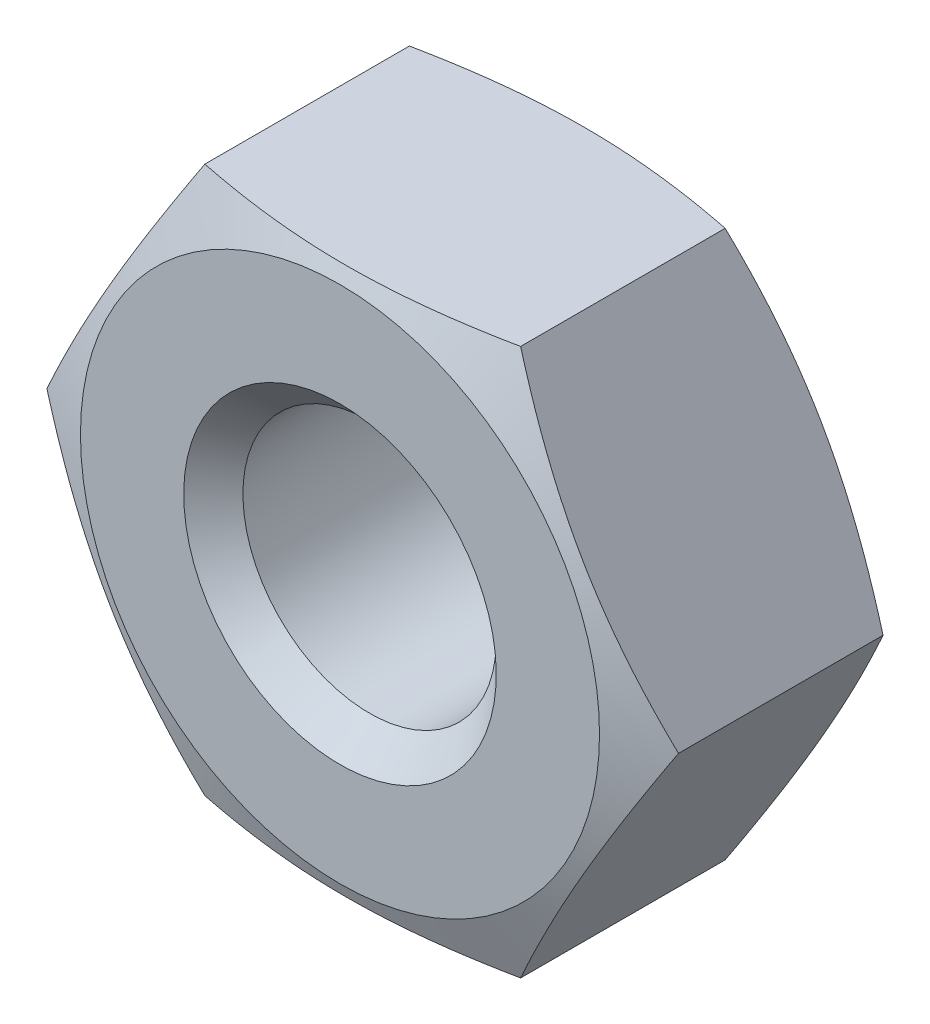
ISO-10303-21;
HEADER;
FILE_DESCRIPTION(('STEP AP214'),'2;1');
FILE_NAME('part.step','',(''),(''),'','','');
FILE_SCHEMA(('AUTOMOTIVE_DESIGN { 1 0 10303 214 1 1 1 1 }'));
ENDSEC;
DATA;
#1=APPLICATION_CONTEXT('core data for automotive mechanical design processes');
#2=APPLICATION_PROTOCOL_DEFINITION('international standard','automotive_design',2000,#1);
#3=PRODUCT_CONTEXT('',#1,'mechanical');
#4=PRODUCT('Part','Part','',(#3));
#5=PRODUCT_RELATED_PRODUCT_CATEGORY('part','',(#4));
#6=PRODUCT_DEFINITION_FORMATION('','',#4);
#7=PRODUCT_DEFINITION_CONTEXT('part definition',#1,'design');
#8=PRODUCT_DEFINITION('design','',#6,#7);
#9=PRODUCT_DEFINITION_SHAPE('','',#8);
#10=(LENGTH_UNIT() NAMED_UNIT(*) SI_UNIT(.MILLI.,.METRE.));
#11=(NAMED_UNIT(*) PLANE_ANGLE_UNIT() SI_UNIT($,.RADIAN.));
#12=(NAMED_UNIT(*) SI_UNIT($,.STERADIAN.) SOLID_ANGLE_UNIT());
#13=UNCERTAINTY_MEASURE_WITH_UNIT(LENGTH_MEASURE(1.E-05),#10,'distance_accuracy_value','');
#14=(GEOMETRIC_REPRESENTATION_CONTEXT(3) GLOBAL_UNCERTAINTY_ASSIGNED_CONTEXT((#13)) GLOBAL_UNIT_ASSIGNED_CONTEXT((#10,
#11,#12)) REPRESENTATION_CONTEXT('',''));
#15=CARTESIAN_POINT('',(0.,0.,0.));
#16=DIRECTION('',(0.,0.,1.));
#17=DIRECTION('',(1.,0.,0.));
#18=AXIS2_PLACEMENT_3D('',#15,#16,#17);
#19=CARTESIAN_POINT('',(0.,0.,0.));
#20=DIRECTION('',(0.,0.,1.));
#21=DIRECTION('',(0.,-1.,0.));
#22=AXIS2_PLACEMENT_3D('',#19,#20,#21);
#23=CONICAL_SURFACE('',#22,3.32142473355163,1.18682389135614);
#24=CARTESIAN_POINT('',(0.,0.,0.));
#25=DIRECTION('',(0.,0.,1.));
#26=DIRECTION('',(1.,0.,0.));
#27=AXIS2_PLACEMENT_3D('',#24,#25,#26);
#28=CIRCLE('',#27,3.32142473355163);
#29=CARTESIAN_POINT('',(3.32142473355163,0.,0.));
#30=VERTEX_POINT('',#29);
#31=EDGE_CURVE('E26',#30,#30,#28,.T.);
#32=ORIENTED_EDGE('',*,*,#31,.T.);
#33=EDGE_LOOP('',(#32));
#34=FACE_BOUND('',#33,.T.);
#35=CARTESIAN_POINT('',(2.02072384529946,3.50000036812462,0.290909557438591));
#36=CARTESIAN_POINT('',(2.09132255034,3.37771982404585,0.262384166173461));
#37=CARTESIAN_POINT('',(2.16215427324609,3.25503568118485,0.236007850277796));
#38=CARTESIAN_POINT('',(2.30428608585132,3.00885616038073,0.188364048957386));
#39=CARTESIAN_POINT('',(2.37558642498468,2.88536035040487,0.167099556959751));
#40=CARTESIAN_POINT('',(2.51855398210177,2.63773327764406,0.130530773869635));
#41=CARTESIAN_POINT('',(2.59022108477342,2.5136022145855,0.115224713605103));
#42=CARTESIAN_POINT('',(2.73382150463953,2.26487899138918,0.0912821023845898));
#43=CARTESIAN_POINT('',(2.80575475967239,2.14028693891846,0.0826440820646217));
#44=CARTESIAN_POINT('',(2.9485261877914,1.89299957154715,0.0725747154128586));
#45=CARTESIAN_POINT('',(3.01936221521324,1.77030797304619,0.0710234885768341));
#46=CARTESIAN_POINT('',(3.16099241001165,1.52499727976948,0.0748851451105576));
#47=CARTESIAN_POINT('',(3.23178657316066,1.40237819231606,0.0802986407331931));
#48=CARTESIAN_POINT('',(3.37311509902853,1.15759000495409,0.0977982137314881));
#49=CARTESIAN_POINT('',(3.4436496078532,1.03542065198286,0.109879661807571));
#50=CARTESIAN_POINT('',(3.58439008838827,0.791650989014452,0.140131203947854));
#51=CARTESIAN_POINT('',(3.65459605425069,0.670050689146307,0.158301405975728));
#52=CARTESIAN_POINT('',(3.75107715753959,0.502940516279635,0.187023064048246));
#53=CARTESIAN_POINT('',(3.77752810257727,0.457126135566159,0.195287900081437));
#54=CARTESIAN_POINT('',(3.83036756262534,0.365605506118386,0.212537278382668));
#55=CARTESIAN_POINT('',(3.85675608642679,0.319899242157537,0.221521712221243));
#56=CARTESIAN_POINT('',(3.90956322437695,0.228434596225564,0.240200703604558));
#57=CARTESIAN_POINT('',(3.93598163188813,0.182676572161136,0.249897588545801));
#58=CARTESIAN_POINT('',(3.98876056400169,0.0912607801712255,0.269933042005469));
#59=CARTESIAN_POINT('',(4.01512108199967,0.0456030236848843,0.280271680164017));
#60=CARTESIAN_POINT('',(4.04145115470054,-2.00000000010724E-06,0.290909557438591));
#61=B_SPLINE_CURVE_WITH_KNOTS('',3,(#35,#36,#37,#38,#39,#40,#41,#42,#43,#44,#45,#46,#47,#48,#49,
#50,#51,#52,#53,#54,#55,#56,#57,#58,#59,#60),.UNSPECIFIED.,.F.,.F.,(4,2,2,2,2,2,2,2,2,2,2,2,4),
(0.,0.432180292003572,0.864613050816601,1.29691731398269,1.72912628770946,2.15399624694487,
2.57890355808278,3.00351624303523,3.42813645747093,3.58876423240477,3.74936784921124,
3.91052168590197,4.0716930409457),.UNSPECIFIED.);
#62=CARTESIAN_POINT('',(2.020725,3.49999836812462,0.290909090909091));
#63=VERTEX_POINT('',#62);
#64=CARTESIAN_POINT('',(4.04145,0.,0.290909090909091));
#65=VERTEX_POINT('',#64);
#66=EDGE_CURVE('E183',#63,#65,#61,.T.);
#67=ORIENTED_EDGE('',*,*,#66,.T.);
#68=CARTESIAN_POINT('',(4.04145115470054,2.E-06,0.290909557438591));
#69=CARTESIAN_POINT('',(3.97085244966001,-0.122278544078773,0.262384166173461));
#70=CARTESIAN_POINT('',(3.90002072675391,-0.244962686939771,0.236007850277796));
#71=CARTESIAN_POINT('',(3.75788891414868,-0.491142207743888,0.188364048957386));
#72=CARTESIAN_POINT('',(3.68658857501532,-0.614638017719752,0.167099556959751));
#73=CARTESIAN_POINT('',(3.54362101789823,-0.862265090480561,0.130530773869635));
#74=CARTESIAN_POINT('',(3.47195391522658,-0.986396153539121,0.115224713605103));
#75=CARTESIAN_POINT('',(3.32835349536047,-1.23511937673544,0.0912821023845898));
#76=CARTESIAN_POINT('',(3.25642024032762,-1.35971142920615,0.0826440820646216));
#77=CARTESIAN_POINT('',(3.1136488122086,-1.60699879657746,0.0725747154128586));
#78=CARTESIAN_POINT('',(3.04281278478676,-1.72969039507843,0.0710234885768343));
#79=CARTESIAN_POINT('',(2.90118258998835,-1.97500108835514,0.0748851451105578));
#80=CARTESIAN_POINT('',(2.83038842683934,-2.09762017580856,0.0802986407331932));
#81=CARTESIAN_POINT('',(2.68905990097147,-2.34240836317053,0.0977982137314883));
#82=CARTESIAN_POINT('',(2.6185253921468,-2.46457771614176,0.109879661807571));
#83=CARTESIAN_POINT('',(2.47778491161173,-2.70834737911017,0.140131203947854));
#84=CARTESIAN_POINT('',(2.40757894574931,-2.82994767897831,0.158301405975728));
#85=CARTESIAN_POINT('',(2.31109784246041,-2.99705785184499,0.187023064048246));
#86=CARTESIAN_POINT('',(2.28464689742273,-3.04287223255846,0.195287900081437));
#87=CARTESIAN_POINT('',(2.23180743737466,-3.13439286200624,0.212537278382668));
#88=CARTESIAN_POINT('',(2.20541891357321,-3.18009912596708,0.221521712221243));
#89=CARTESIAN_POINT('',(2.15261177562305,-3.27156377189906,0.240200703604558));
#90=CARTESIAN_POINT('',(2.12619336811187,-3.31732179596348,0.249897588545801));
#91=CARTESIAN_POINT('',(2.07341443599831,-3.40873758795339,0.269933042005469));
#92=CARTESIAN_POINT('',(2.04705391800033,-3.45439534443974,0.280271680164018));
#93=CARTESIAN_POINT('',(2.02072384529946,-3.50000036812462,0.290909557438591));
#94=B_SPLINE_CURVE_WITH_KNOTS('',3,(#68,#69,#70,#71,#72,#73,#74,#75,#76,#77,#78,#79,#80,#81,#82,
#83,#84,#85,#86,#87,#88,#89,#90,#91,#92,#93),.UNSPECIFIED.,.F.,.F.,(4,2,2,2,2,2,2,2,2,2,2,2,4),
(0.,0.432180292003572,0.864613050816601,1.29691731398269,1.72912628770947,2.15399624694487,
2.57890355808279,3.00351624303523,3.42813645747093,3.58876423240478,3.74936784921125,
3.91052168590198,4.07169304094571),.UNSPECIFIED.);
#95=CARTESIAN_POINT('',(2.020725,-3.49999836812462,0.290909090909091));
#96=VERTEX_POINT('',#95);
#97=EDGE_CURVE('E33',#65,#96,#94,.T.);
#98=ORIENTED_EDGE('',*,*,#97,.T.);
#99=CARTESIAN_POINT('',(-5.34553881756547,-3.49999836812462,1.23955326396827));
#100=CARTESIAN_POINT('',(-5.18762264254,-3.49999836812462,1.18619003500022));
#101=CARTESIAN_POINT('',(-5.02949661339175,-3.49999836812462,1.13343638207835));
#102=CARTESIAN_POINT('',(-4.71271625132204,-3.49999836812462,1.02948880535383));
#103=CARTESIAN_POINT('',(-4.5540618683599,-3.49999836812462,0.978295034234388));
#104=CARTESIAN_POINT('',(-4.2357643457523,-3.49999836812462,0.877697414375918));
#105=CARTESIAN_POINT('',(-4.07611974532071,-3.49999836812462,0.828298170910141));
#106=CARTESIAN_POINT('',(-3.75611019253561,-3.49999836812462,0.731895685603083));
#107=CARTESIAN_POINT('',(-3.59574525773822,-3.49999836812462,0.684892385708541));
#108=CARTESIAN_POINT('',(-3.27623888700588,-3.49999836812462,0.594472747430541));
#109=CARTESIAN_POINT('',(-3.11710839667555,-3.49999836812462,0.551017924543446));
#110=CARTESIAN_POINT('',(-2.79787990473444,-3.49999836812462,0.46777255382096));
#111=CARTESIAN_POINT('',(-2.63778187418168,-3.49999836812462,0.427982116181993));
#112=CARTESIAN_POINT('',(-2.31659647071351,-3.49999836812462,0.353015300891237));
#113=CARTESIAN_POINT('',(-2.15550971461305,-3.49999836812462,0.317836302746271));
#114=CARTESIAN_POINT('',(-1.83218709180317,-3.49999836812462,0.253177369741271));
#115=CARTESIAN_POINT('',(-1.6699512791965,-3.49999836812462,0.223697168381369));
#116=CARTESIAN_POINT('',(-1.37764525829404,-3.49999836812462,0.17698925553565));
#117=CARTESIAN_POINT('',(-1.24777946462564,-3.49999836812462,0.158488793465168));
#118=CARTESIAN_POINT('',(-0.987441249599447,-3.49999836812462,0.126494693607928));
#119=CARTESIAN_POINT('',(-0.856968908113897,-3.49999836812462,0.11300041449888));
#120=CARTESIAN_POINT('',(-0.595642853519168,-3.49999836812462,0.091549504847724));
#121=CARTESIAN_POINT('',(-0.464789416808147,-3.49999836812462,0.0835895503648877));
#122=CARTESIAN_POINT('',(-0.202855028065162,-3.49999836812462,0.0735420763055132));
#123=CARTESIAN_POINT('',(-0.0717740778707208,-3.49999836812462,0.0714545095191927));
#124=CARTESIAN_POINT('',(0.190984740304119,-3.49999836812462,0.0732524329481938));
#125=CARTESIAN_POINT('',(0.322662407086359,-3.49999836812462,0.077167055765279));
#126=CARTESIAN_POINT('',(0.585711212547456,-3.49999836812462,0.090843208473379));
#127=CARTESIAN_POINT('',(0.717082346110813,-3.49999836812462,0.100604835249881));
#128=CARTESIAN_POINT('',(0.97938623667146,-3.49999836812462,0.125563453075726));
#129=CARTESIAN_POINT('',(1.110318659208,-3.49999836812462,0.140763919565631));
#130=CARTESIAN_POINT('',(1.37151539079655,-3.49999836812462,0.176029675990628));
#131=CARTESIAN_POINT('',(1.50177970215209,-3.49999836812462,0.196094949141129));
#132=CARTESIAN_POINT('',(1.93664115430619,-3.49999836812462,0.270318042931076));
#133=CARTESIAN_POINT('',(2.23962712444599,-3.49999836812462,0.333982330885962));
#134=CARTESIAN_POINT('',(2.69125779261715,-3.49999836812462,0.441186370822009));
#135=CARTESIAN_POINT('',(2.84137819783595,-3.49999836812462,0.478887425419062));
#136=CARTESIAN_POINT('',(3.14078451169961,-3.49999836812462,0.557477868316505));
#137=CARTESIAN_POINT('',(3.29007045189538,-3.49999836812462,0.598367135185511));
#138=CARTESIAN_POINT('',(3.73762543539227,-3.49999836812462,0.725085144224423));
#139=CARTESIAN_POINT('',(4.03479692474104,-3.49999836812462,0.814768265604585));
#140=CARTESIAN_POINT('',(4.62691345988182,-3.49999836812462,1.00084877207955));
#141=CARTESIAN_POINT('',(4.92185906558101,-3.49999836812462,1.09724440174606));
#142=CARTESIAN_POINT('',(5.5082044578059,-3.49999836812462,1.29396354290783));
#143=CARTESIAN_POINT('',(5.7996147238003,-3.49999836812462,1.3942559576467));
#144=CARTESIAN_POINT('',(6.3813353040554,-3.49999836812462,1.59803886260046));
#145=CARTESIAN_POINT('',(6.67164553142866,-3.49999836812462,1.70152959976056));
#146=CARTESIAN_POINT('',(7.2494935330203,-3.49999836812462,1.91011313885032));
#147=CARTESIAN_POINT('',(7.53703686264068,-3.49999836812463,2.01519059339234));
#148=CARTESIAN_POINT('',(8.11144984025393,-3.49999836812463,2.22705888137605));
#149=CARTESIAN_POINT('',(8.39831957079732,-3.49999836812463,2.33384949079267));
#150=CARTESIAN_POINT('',(8.684964011713,-3.49999836812463,2.44123143152209));
#151=B_SPLINE_CURVE_WITH_KNOTS('',3,(#99,#100,#101,#102,#103,#104,#105,#106,#107,#108,#109,#110,
#111,#112,#113,#114,#115,#116,#117,#118,#119,#120,#121,#122,#123,#124,#125,#126,#127,#128,#129,
#130,#131,#132,#133,#134,#135,#136,#137,#138,#139,#140,#141,#142,#143,#144,#145,#146,#147,#148,
#149,#150),.UNSPECIFIED.,.F.,.F.,(4,2,2,2,2,2,2,2,2,2,2,2,2,2,2,2,2,2,2,2,2,2,2,2,2,4),(0.,
0.500070610096159,1.000190011517,1.50151328171155,2.00282439915781,2.49766131259613,
2.99251310205319,3.48708245697461,3.98162867814071,4.375075815661,4.76847253280626,
5.16163276949894,5.55478984545646,5.94986122269567,6.34493914649139,6.74026997886341,
7.13559944728154,8.06362736797857,8.5279634818099,8.99228191881982,9.92337262496777,
10.8542207438853,11.778751567274,12.7033539537072,13.6217714521181,14.5400698147867),.UNSPECIFIED.);
#152=CARTESIAN_POINT('',(-2.020725,-3.49999836812462,0.290909090909091));
#153=VERTEX_POINT('',#152);
#154=EDGE_CURVE('E76',#96,#153,#151,.F.);
#155=ORIENTED_EDGE('',*,*,#154,.T.);
#156=CARTESIAN_POINT('',(-2.02072384529946,-3.50000036812462,0.290909557438592));
#157=CARTESIAN_POINT('',(-2.09132255034,-3.37771982404585,0.262384166173461));
#158=CARTESIAN_POINT('',(-2.16215427324609,-3.25503568118485,0.236007850277796));
#159=CARTESIAN_POINT('',(-2.30428608585132,-3.00885616038073,0.188364048957386));
#160=CARTESIAN_POINT('',(-2.37558642498468,-2.88536035040487,0.167099556959751));
#161=CARTESIAN_POINT('',(-2.51855398210177,-2.63773327764406,0.130530773869635));
#162=CARTESIAN_POINT('',(-2.59022108477342,-2.5136022145855,0.115224713605103));
#163=CARTESIAN_POINT('',(-2.73382150463953,-2.26487899138918,0.0912821023845899));
#164=CARTESIAN_POINT('',(-2.80575475967239,-2.14028693891846,0.0826440820646219));
#165=CARTESIAN_POINT('',(-2.94852618779141,-1.89299957154715,0.0725747154128589));
#166=CARTESIAN_POINT('',(-3.01936221521324,-1.77030797304619,0.0710234885768342));
#167=CARTESIAN_POINT('',(-3.16099241001165,-1.52499727976947,0.0748851451105577));
#168=CARTESIAN_POINT('',(-3.23178657316066,-1.40237819231606,0.0802986407331933));
#169=CARTESIAN_POINT('',(-3.37311509902854,-1.15759000495409,0.0977982137314883));
#170=CARTESIAN_POINT('',(-3.4436496078532,-1.03542065198285,0.109879661807571));
#171=CARTESIAN_POINT('',(-3.58439008838827,-0.79165098901445,0.140131203947855));
#172=CARTESIAN_POINT('',(-3.65459605425069,-0.670050689146305,0.158301405975729));
#173=CARTESIAN_POINT('',(-3.75107715753959,-0.502940516279633,0.187023064048246));
#174=CARTESIAN_POINT('',(-3.77752810257727,-0.457126135566158,0.195287900081437));
#175=CARTESIAN_POINT('',(-3.83036756262534,-0.365605506118384,0.212537278382668));
#176=CARTESIAN_POINT('',(-3.85675608642679,-0.319899242157536,0.221521712221243));
#177=CARTESIAN_POINT('',(-3.90956322437695,-0.228434596225564,0.240200703604558));
#178=CARTESIAN_POINT('',(-3.93598163188813,-0.182676572161136,0.249897588545801));
#179=CARTESIAN_POINT('',(-3.98876056400169,-0.0912607801712251,0.269933042005469));
#180=CARTESIAN_POINT('',(-4.01512108199967,-0.0456030236848838,0.280271680164017));
#181=CARTESIAN_POINT('',(-4.04145115470054,2.00000000047332E-06,0.290909557438591));
#182=B_SPLINE_CURVE_WITH_KNOTS('',3,(#156,#157,#158,#159,#160,#161,#162,#163,#164,#165,#166,
#167,#168,#169,#170,#171,#172,#173,#174,#175,#176,#177,#178,#179,#180,#181),.UNSPECIFIED.,.F.,
.F.,(4,2,2,2,2,2,2,2,2,2,2,2,4),(0.,0.432180292003571,0.8646130508166,1.29691731398269,
1.72912628770947,2.15399624694487,2.57890355808279,3.00351624303523,3.42813645747093,
3.58876423240477,3.74936784921125,3.91052168590198,4.07169304094571),.UNSPECIFIED.);
#183=CARTESIAN_POINT('',(-4.04145,0.,0.290909090909091));
#184=VERTEX_POINT('',#183);
#185=EDGE_CURVE('E87',#153,#184,#182,.T.);
#186=ORIENTED_EDGE('',*,*,#185,.T.);
#187=CARTESIAN_POINT('',(-4.04145115470054,-1.99999999944489E-06,0.290909557438591));
#188=CARTESIAN_POINT('',(-3.97085244966001,0.122278544078773,0.262384166173461));
#189=CARTESIAN_POINT('',(-3.90002072675391,0.244962686939772,0.236007850277796));
#190=CARTESIAN_POINT('',(-3.75788891414868,0.491142207743889,0.188364048957386));
#191=CARTESIAN_POINT('',(-3.68658857501532,0.614638017719753,0.167099556959751));
#192=CARTESIAN_POINT('',(-3.54362101789823,0.862265090480562,0.130530773869635));
#193=CARTESIAN_POINT('',(-3.47195391522658,0.986396153539121,0.115224713605103));
#194=CARTESIAN_POINT('',(-3.32835349536047,1.23511937673544,0.0912821023845896));
#195=CARTESIAN_POINT('',(-3.25642024032762,1.35971142920616,0.0826440820646215));
#196=CARTESIAN_POINT('',(-3.1136488122086,1.60699879657747,0.0725747154128584));
#197=CARTESIAN_POINT('',(-3.04281278478676,1.72969039507843,0.071023488576834));
#198=CARTESIAN_POINT('',(-2.90118258998835,1.97500108835514,0.0748851451105575));
#199=CARTESIAN_POINT('',(-2.83038842683934,2.09762017580856,0.0802986407331927));
#200=CARTESIAN_POINT('',(-2.68905990097147,2.34240836317053,0.0977982137314878));
#201=CARTESIAN_POINT('',(-2.6185253921468,2.46457771614176,0.109879661807571));
#202=CARTESIAN_POINT('',(-2.47778491161173,2.70834737911017,0.140131203947854));
#203=CARTESIAN_POINT('',(-2.40757894574931,2.82994767897831,0.158301405975728));
#204=CARTESIAN_POINT('',(-2.31109784246041,2.99705785184499,0.187023064048246));
#205=CARTESIAN_POINT('',(-2.28464689742274,3.04287223255846,0.195287900081437));
#206=CARTESIAN_POINT('',(-2.23180743737466,3.13439286200623,0.212537278382668));
#207=CARTESIAN_POINT('',(-2.20541891357321,3.18009912596708,0.221521712221243));
#208=CARTESIAN_POINT('',(-2.15261177562305,3.27156377189906,0.240200703604558));
#209=CARTESIAN_POINT('',(-2.12619336811187,3.31732179596348,0.249897588545801));
#210=CARTESIAN_POINT('',(-2.07341443599831,3.40873758795339,0.269933042005469));
#211=CARTESIAN_POINT('',(-2.04705391800033,3.45439534443974,0.280271680164017));
#212=CARTESIAN_POINT('',(-2.02072384529946,3.50000036812462,0.290909557438591));
#213=B_SPLINE_CURVE_WITH_KNOTS('',3,(#187,#188,#189,#190,#191,#192,#193,#194,#195,#196,#197,
#198,#199,#200,#201,#202,#203,#204,#205,#206,#207,#208,#209,#210,#211,#212),.UNSPECIFIED.,.F.,
.F.,(4,2,2,2,2,2,2,2,2,2,2,2,4),(0.,0.432180292003572,0.864613050816601,1.29691731398269,
1.72912628770947,2.15399624694487,2.57890355808279,3.00351624303523,3.42813645747093,
3.58876423240477,3.74936784921125,3.91052168590198,4.07169304094571),.UNSPECIFIED.);
#214=CARTESIAN_POINT('',(-2.020725,3.49999836812462,0.290909090909091));
#215=VERTEX_POINT('',#214);
#216=EDGE_CURVE('E93',#184,#215,#213,.T.);
#217=ORIENTED_EDGE('',*,*,#216,.T.);
#218=CARTESIAN_POINT('',(-5.34553881756546,3.49999836812462,1.23955326396827));
#219=CARTESIAN_POINT('',(-5.18762264253999,3.49999836812462,1.18619003500022));
#220=CARTESIAN_POINT('',(-5.02949661339174,3.49999836812462,1.13343638207835));
#221=CARTESIAN_POINT('',(-4.71271625132203,3.49999836812462,1.02948880535383));
#222=CARTESIAN_POINT('',(-4.55406186835989,3.49999836812462,0.978295034234386));
#223=CARTESIAN_POINT('',(-4.23576434575229,3.49999836812462,0.877697414375917));
#224=CARTESIAN_POINT('',(-4.0761197453207,3.49999836812462,0.828298170910139));
#225=CARTESIAN_POINT('',(-3.75611019253561,3.49999836812462,0.731895685603081));
#226=CARTESIAN_POINT('',(-3.59574525773821,3.49999836812462,0.684892385708539));
#227=CARTESIAN_POINT('',(-3.27623888700587,3.49999836812462,0.594472747430539));
#228=CARTESIAN_POINT('',(-3.11710839667555,3.49999836812462,0.551017924543444));
#229=CARTESIAN_POINT('',(-2.79787990473443,3.49999836812462,0.467772553820959));
#230=CARTESIAN_POINT('',(-2.63778187418168,3.49999836812462,0.427982116181991));
#231=CARTESIAN_POINT('',(-2.31659647071351,3.49999836812462,0.353015300891236));
#232=CARTESIAN_POINT('',(-2.15550971461304,3.49999836812462,0.317836302746269));
#233=CARTESIAN_POINT('',(-1.83218709180317,3.49999836812462,0.25317736974127));
#234=CARTESIAN_POINT('',(-1.66995127919649,3.49999836812462,0.223697168381369));
#235=CARTESIAN_POINT('',(-1.37764525829403,3.49999836812462,0.17698925553565));
#236=CARTESIAN_POINT('',(-1.24777946462564,3.49999836812462,0.158488793465167));
#237=CARTESIAN_POINT('',(-0.987441249599443,3.49999836812462,0.126494693607927));
#238=CARTESIAN_POINT('',(-0.856968908113894,3.49999836812462,0.113000414498879));
#239=CARTESIAN_POINT('',(-0.595642853519165,3.49999836812462,0.0915495048477233));
#240=CARTESIAN_POINT('',(-0.464789416808144,3.49999836812462,0.0835895503648871));
#241=CARTESIAN_POINT('',(-0.20285502806516,3.49999836812462,0.0735420763055127));
#242=CARTESIAN_POINT('',(-0.0717740778707185,3.49999836812462,0.0714545095191921));
#243=CARTESIAN_POINT('',(0.190984740304121,3.49999836812462,0.0732524329481931));
#244=CARTESIAN_POINT('',(0.322662407086361,3.49999836812462,0.0771670557652782));
#245=CARTESIAN_POINT('',(0.585711212547458,3.49999836812462,0.0908432084733782));
#246=CARTESIAN_POINT('',(0.717082346110815,3.49999836812462,0.10060483524988));
#247=CARTESIAN_POINT('',(0.979386236671462,3.49999836812462,0.125563453075725));
#248=CARTESIAN_POINT('',(1.11031865920801,3.49999836812462,0.14076391956563));
#249=CARTESIAN_POINT('',(1.37151539079655,3.49999836812462,0.176029675990627));
#250=CARTESIAN_POINT('',(1.5017797021521,3.49999836812462,0.196094949141129));
#251=CARTESIAN_POINT('',(1.93664115430619,3.49999836812462,0.270318042931076));
#252=CARTESIAN_POINT('',(2.23962712444599,3.49999836812462,0.333982330885961));
#253=CARTESIAN_POINT('',(2.69125779261715,3.49999836812462,0.441186370822008));
#254=CARTESIAN_POINT('',(2.84137819783595,3.49999836812462,0.478887425419061));
#255=CARTESIAN_POINT('',(3.14078451169961,3.49999836812462,0.557477868316504));
#256=CARTESIAN_POINT('',(3.29007045189538,3.49999836812462,0.59836713518551));
#257=CARTESIAN_POINT('',(3.73762543539227,3.49999836812462,0.725085144224422));
#258=CARTESIAN_POINT('',(4.03479692474104,3.49999836812462,0.814768265604584));
#259=CARTESIAN_POINT('',(4.62691345988182,3.49999836812462,1.00084877207955));
#260=CARTESIAN_POINT('',(4.92185906558101,3.49999836812462,1.09724440174607));
#261=CARTESIAN_POINT('',(5.50820445780591,3.49999836812462,1.29396354290783));
#262=CARTESIAN_POINT('',(5.79961472380031,3.49999836812462,1.3942559576467));
#263=CARTESIAN_POINT('',(6.38133530405541,3.49999836812462,1.59803886260046));
#264=CARTESIAN_POINT('',(6.67164553142867,3.49999836812462,1.70152959976056));
#265=CARTESIAN_POINT('',(7.24949353302031,3.49999836812462,1.91011313885033));
#266=CARTESIAN_POINT('',(7.53703686264069,3.49999836812462,2.01519059339235));
#267=CARTESIAN_POINT('',(8.11144984025394,3.49999836812462,2.22705888137606));
#268=CARTESIAN_POINT('',(8.39831957079733,3.49999836812462,2.33384949079268));
#269=CARTESIAN_POINT('',(8.68496401171301,3.49999836812462,2.44123143152209));
#270=B_SPLINE_CURVE_WITH_KNOTS('',3,(#218,#219,#220,#221,#222,#223,#224,#225,#226,#227,#228,
#229,#230,#231,#232,#233,#234,#235,#236,#237,#238,#239,#240,#241,#242,#243,#244,#245,#246,#247,
#248,#249,#250,#251,#252,#253,#254,#255,#256,#257,#258,#259,#260,#261,#262,#263,#264,#265,#266,
#267,#268,#269),.UNSPECIFIED.,.F.,.F.,(4,2,2,2,2,2,2,2,2,2,2,2,2,2,2,2,2,2,2,2,2,2,2,2,2,4),(0.,
0.500070610096158,1.000190011517,1.50151328171154,2.00282439915781,2.49766131259613,
2.99251310205318,3.4870824569746,3.9816286781407,4.37507581566099,4.76847253280625,
5.16163276949893,5.55478984545645,5.94986122269566,6.34493914649138,6.7402699788634,
7.13559944728153,8.06362736797856,8.52796348180989,8.99228191881981,9.92337262496776,
10.8542207438853,11.778751567274,12.7033539537072,13.6217714521181,14.5400698147867),.UNSPECIFIED.);
#271=EDGE_CURVE('E189',#215,#63,#270,.T.);
#272=ORIENTED_EDGE('',*,*,#271,.T.);
#273=EDGE_LOOP('',(#67,#98,#155,#186,#217,#272));
#274=FACE_BOUND('',#273,.T.);
#275=ADVANCED_FACE('F16',(#34,#274),#23,.T.);
#276=CARTESIAN_POINT('',(4.04145,0.,0.));
#277=DIRECTION('',(0.,0.,1.));
#278=DIRECTION('',(1.,0.,0.));
#279=AXIS2_PLACEMENT_3D('',#276,#277,#278);
#280=PLANE('',#279);
#281=CARTESIAN_POINT('',(0.,0.,0.));
#282=DIRECTION('',(0.,0.,1.));
#283=DIRECTION('',(1.,0.,0.));
#284=AXIS2_PLACEMENT_3D('',#281,#282,#283);
#285=CIRCLE('',#284,2.);
#286=CARTESIAN_POINT('',(2.,0.,0.));
#287=VERTEX_POINT('',#286);
#288=EDGE_CURVE('E11',#287,#287,#285,.F.);
#289=ORIENTED_EDGE('',*,*,#288,.F.);
#290=EDGE_LOOP('',(#289));
#291=FACE_BOUND('',#290,.T.);
#292=ORIENTED_EDGE('',*,*,#31,.F.);
#293=EDGE_LOOP('',(#292));
#294=FACE_BOUND('',#293,.T.);
#295=ADVANCED_FACE('F211',(#291,#294),#280,.F.);
#296=CARTESIAN_POINT('',(0.,0.,3.2));
#297=DIRECTION('',(0.,0.,1.));
#298=DIRECTION('',(0.,-1.,0.));
#299=AXIS2_PLACEMENT_3D('',#296,#297,#298);
#300=CONICAL_SURFACE('',#299,2.,0.785398163397448);
#301=CARTESIAN_POINT('',(0.,0.,2.821125));
#302=DIRECTION('',(0.,0.,-1.));
#303=DIRECTION('',(0.,1.,0.));
#304=AXIS2_PLACEMENT_3D('',#301,#302,#303);
#305=CIRCLE('',#304,1.621125);
#306=CARTESIAN_POINT('',(0.,1.621125,2.821125));
#307=VERTEX_POINT('',#306);
#308=EDGE_CURVE('E379',#307,#307,#305,.T.);
#309=ORIENTED_EDGE('',*,*,#308,.T.);
#310=EDGE_LOOP('',(#309));
#311=FACE_BOUND('',#310,.T.);
#312=CARTESIAN_POINT('',(0.,0.,3.2));
#313=DIRECTION('',(0.,0.,-1.));
#314=DIRECTION('',(0.,1.,0.));
#315=AXIS2_PLACEMENT_3D('',#312,#313,#314);
#316=CIRCLE('',#315,2.);
#317=CARTESIAN_POINT('',(0.,2.,3.2));
#318=VERTEX_POINT('',#317);
#319=EDGE_CURVE('E104',#318,#318,#316,.T.);
#320=ORIENTED_EDGE('',*,*,#319,.F.);
#321=EDGE_LOOP('',(#320));
#322=FACE_BOUND('',#321,.T.);
#323=ADVANCED_FACE('F149',(#311,#322),#300,.F.);
#324=CARTESIAN_POINT('',(0.,0.,0.));
#325=DIRECTION('',(0.,0.,-1.));
#326=DIRECTION('',(0.,1.,0.));
#327=AXIS2_PLACEMENT_3D('',#324,#325,#326);
#328=CYLINDRICAL_SURFACE('',#327,1.621125);
#329=CARTESIAN_POINT('',(0.,0.,0.378875));
#330=DIRECTION('',(0.,0.,-1.));
#331=DIRECTION('',(0.,1.,0.));
#332=AXIS2_PLACEMENT_3D('',#329,#330,#331);
#333=CIRCLE('',#332,1.621125);
#334=CARTESIAN_POINT('',(0.,1.621125,0.378875));
#335=VERTEX_POINT('',#334);
#336=EDGE_CURVE('E375',#335,#335,#333,.T.);
#337=ORIENTED_EDGE('',*,*,#336,.T.);
#338=EDGE_LOOP('',(#337));
#339=FACE_BOUND('',#338,.T.);
#340=ORIENTED_EDGE('',*,*,#308,.F.);
#341=EDGE_LOOP('',(#340));
#342=FACE_BOUND('',#341,.T.);
#343=ADVANCED_FACE('F329',(#339,#342),#328,.F.);
#344=CARTESIAN_POINT('',(0.,0.,0.378875));
#345=DIRECTION('',(0.,0.,-1.));
#346=DIRECTION('',(0.,1.,0.));
#347=AXIS2_PLACEMENT_3D('',#344,#345,#346);
#348=CONICAL_SURFACE('',#347,1.621125,0.785398163397448);
#349=ORIENTED_EDGE('',*,*,#288,.T.);
#350=EDGE_LOOP('',(#349));
#351=FACE_BOUND('',#350,.T.);
#352=ORIENTED_EDGE('',*,*,#336,.F.);
#353=EDGE_LOOP('',(#352));
#354=FACE_BOUND('',#353,.T.);
#355=ADVANCED_FACE('F323',(#351,#354),#348,.F.);
#356=CARTESIAN_POINT('',(4.04145,0.,3.2));
#357=DIRECTION('',(0.,0.,1.));
#358=DIRECTION('',(1.,0.,0.));
#359=AXIS2_PLACEMENT_3D('',#356,#357,#358);
#360=PLANE('',#359);
#361=CARTESIAN_POINT('',(0.,0.,3.2));
#362=DIRECTION('',(0.,0.,-1.));
#363=DIRECTION('',(0.,1.,0.));
#364=AXIS2_PLACEMENT_3D('',#361,#362,#363);
#365=CIRCLE('',#364,3.32142473355163);
#366=CARTESIAN_POINT('',(0.,3.32142473355163,3.2));
#367=VERTEX_POINT('',#366);
#368=EDGE_CURVE('E97',#367,#367,#365,.T.);
#369=ORIENTED_EDGE('',*,*,#368,.F.);
#370=EDGE_LOOP('',(#369));
#371=FACE_BOUND('',#370,.T.);
#372=ORIENTED_EDGE('',*,*,#319,.T.);
#373=EDGE_LOOP('',(#372));
#374=FACE_BOUND('',#373,.T.);
#375=ADVANCED_FACE('F123',(#371,#374),#360,.T.);
#376=CARTESIAN_POINT('',(0.,0.,2.90909090909091));
#377=DIRECTION('',(0.,0.,-1.));
#378=DIRECTION('',(0.,1.,0.));
#379=AXIS2_PLACEMENT_3D('',#376,#377,#378);
#380=CONICAL_SURFACE('',#379,4.04145,1.18682389135614);
#381=ORIENTED_EDGE('',*,*,#368,.T.);
#382=EDGE_LOOP('',(#381));
#383=FACE_BOUND('',#382,.T.);
#384=CARTESIAN_POINT('',(-5.34553881756547,-3.49999836812462,1.96044673603173));
#385=CARTESIAN_POINT('',(-5.18762264254,-3.49999836812462,2.01380996499978));
#386=CARTESIAN_POINT('',(-5.02949661339175,-3.49999836812462,2.06656361792165));
#387=CARTESIAN_POINT('',(-4.71271625132204,-3.49999836812462,2.17051119464617));
#388=CARTESIAN_POINT('',(-4.5540618683599,-3.49999836812462,2.22170496576561));
#389=CARTESIAN_POINT('',(-4.2357643457523,-3.49999836812462,2.32230258562408));
#390=CARTESIAN_POINT('',(-4.07611974532071,-3.49999836812462,2.37170182908986));
#391=CARTESIAN_POINT('',(-3.75611019253561,-3.49999836812462,2.46810431439692));
#392=CARTESIAN_POINT('',(-3.59574525773822,-3.49999836812462,2.51510761429146));
#393=CARTESIAN_POINT('',(-3.27623888700588,-3.49999836812462,2.60552725256946));
#394=CARTESIAN_POINT('',(-3.11710839667555,-3.49999836812462,2.64898207545655));
#395=CARTESIAN_POINT('',(-2.79787990473444,-3.49999836812462,2.73222744617904));
#396=CARTESIAN_POINT('',(-2.63778187418168,-3.49999836812462,2.77201788381801));
#397=CARTESIAN_POINT('',(-2.31659647071351,-3.49999836812462,2.84698469910876));
#398=CARTESIAN_POINT('',(-2.15550971461305,-3.49999836812462,2.88216369725373));
#399=CARTESIAN_POINT('',(-1.83218709180318,-3.49999836812462,2.94682263025873));
#400=CARTESIAN_POINT('',(-1.6699512791965,-3.49999836812462,2.97630283161863));
#401=CARTESIAN_POINT('',(-1.37764525829404,-3.49999836812462,3.02301074446435));
#402=CARTESIAN_POINT('',(-1.24777946462564,-3.49999836812462,3.04151120653483));
#403=CARTESIAN_POINT('',(-0.987441249599447,-3.49999836812462,3.07350530639207));
#404=CARTESIAN_POINT('',(-0.856968908113898,-3.49999836812462,3.08699958550112));
#405=CARTESIAN_POINT('',(-0.595642853519169,-3.49999836812462,3.10845049515228));
#406=CARTESIAN_POINT('',(-0.464789416808148,-3.49999836812462,3.11641044963511));
#407=CARTESIAN_POINT('',(-0.202855028065164,-3.49999836812462,3.12645792369449));
#408=CARTESIAN_POINT('',(-0.0717740778707225,-3.49999836812462,3.12854549048081));
#409=CARTESIAN_POINT('',(0.190984740304117,-3.49999836812462,3.12674756705181));
#410=CARTESIAN_POINT('',(0.322662407086357,-3.49999836812462,3.12283294423472));
#411=CARTESIAN_POINT('',(0.585711212547454,-3.49999836812462,3.10915679152662));
#412=CARTESIAN_POINT('',(0.71708234611081,-3.49999836812462,3.09939516475012));
#413=CARTESIAN_POINT('',(0.979386236671457,-3.49999836812462,3.07443654692428));
#414=CARTESIAN_POINT('',(1.110318659208,-3.49999836812462,3.05923608043437));
#415=CARTESIAN_POINT('',(1.37151539079655,-3.49999836812462,3.02397032400937));
#416=CARTESIAN_POINT('',(1.50177970215209,-3.49999836812462,3.00390505085887));
#417=CARTESIAN_POINT('',(1.93664115430619,-3.49999836812462,2.92968195706892));
#418=CARTESIAN_POINT('',(2.23962712444599,-3.49999836812462,2.86601766911404));
#419=CARTESIAN_POINT('',(2.69125779261714,-3.49999836812462,2.75881362917799));
#420=CARTESIAN_POINT('',(2.84137819783595,-3.49999836812462,2.72111257458094));
#421=CARTESIAN_POINT('',(3.14078451169961,-3.49999836812462,2.6425221316835));
#422=CARTESIAN_POINT('',(3.29007045189538,-3.49999836812462,2.60163286481449));
#423=CARTESIAN_POINT('',(3.73762543539226,-3.49999836812462,2.47491485577558));
#424=CARTESIAN_POINT('',(4.03479692474103,-3.49999836812462,2.38523173439542));
#425=CARTESIAN_POINT('',(4.62691345988181,-3.49999836812462,2.19915122792045));
#426=CARTESIAN_POINT('',(4.921859065581,-3.49999836812462,2.10275559825394));
#427=CARTESIAN_POINT('',(5.5082044578059,-3.49999836812462,1.90603645709217));
#428=CARTESIAN_POINT('',(5.7996147238003,-3.49999836812462,1.8057440423533));
#429=CARTESIAN_POINT('',(6.3813353040554,-3.49999836812462,1.60196113739954));
#430=CARTESIAN_POINT('',(6.67164553142866,-3.49999836812462,1.49847040023944));
#431=CARTESIAN_POINT('',(7.2494935330203,-3.49999836812462,1.28988686114967));
#432=CARTESIAN_POINT('',(7.53703686264067,-3.49999836812463,1.18480940660765));
#433=CARTESIAN_POINT('',(8.11144984025393,-3.49999836812463,0.972941118623943));
#434=CARTESIAN_POINT('',(8.39831957079732,-3.49999836812463,0.866150509207323));
#435=CARTESIAN_POINT('',(8.684964011713,-3.49999836812463,0.758768568477902));
#436=B_SPLINE_CURVE_WITH_KNOTS('',3,(#384,#385,#386,#387,#388,#389,#390,#391,#392,#393,#394,
#395,#396,#397,#398,#399,#400,#401,#402,#403,#404,#405,#406,#407,#408,#409,#410,#411,#412,#413,
#414,#415,#416,#417,#418,#419,#420,#421,#422,#423,#424,#425,#426,#427,#428,#429,#430,#431,#432,
#433,#434,#435),.UNSPECIFIED.,.F.,.F.,(4,2,2,2,2,2,2,2,2,2,2,2,2,2,2,2,2,2,2,2,2,2,2,2,2,4),(0.,
0.500070610096159,1.000190011517,1.50151328171155,2.00282439915781,2.49766131259613,
2.99251310205319,3.48708245697461,3.98162867814071,4.375075815661,4.76847253280626,
5.16163276949894,5.55478984545645,5.94986122269566,6.34493914649139,6.7402699788634,
7.13559944728154,8.06362736797857,8.52796348180989,8.99228191881982,9.92337262496777,
10.8542207438853,11.778751567274,12.7033539537072,13.6217714521181,14.5400698147867),.UNSPECIFIED.);
#437=CARTESIAN_POINT('',(-2.020725,-3.49999836812462,2.90909090909091));
#438=VERTEX_POINT('',#437);
#439=CARTESIAN_POINT('',(2.020725,-3.49999836812462,2.90909090909091));
#440=VERTEX_POINT('',#439);
#441=EDGE_CURVE('E78',#438,#440,#436,.T.);
#442=ORIENTED_EDGE('',*,*,#441,.T.);
#443=CARTESIAN_POINT('',(2.02072384529946,-3.50000036812462,2.90909044256141));
#444=CARTESIAN_POINT('',(2.09132255033999,-3.37771982404585,2.93761583382654));
#445=CARTESIAN_POINT('',(2.16215427324609,-3.25503568118485,2.9639921497222));
#446=CARTESIAN_POINT('',(2.30428608585132,-3.00885616038073,3.01163595104261));
#447=CARTESIAN_POINT('',(2.37558642498468,-2.88536035040487,3.03290044304025));
#448=CARTESIAN_POINT('',(2.51855398210177,-2.63773327764406,3.06946922613036));
#449=CARTESIAN_POINT('',(2.59022108477342,-2.5136022145855,3.0847752863949));
#450=CARTESIAN_POINT('',(2.73382150463953,-2.26487899138919,3.10871789761541));
#451=CARTESIAN_POINT('',(2.80575475967238,-2.14028693891847,3.11735591793538));
#452=CARTESIAN_POINT('',(2.9485261877914,-1.89299957154716,3.12742528458714));
#453=CARTESIAN_POINT('',(3.01936221521324,-1.77030797304619,3.12897651142317));
#454=CARTESIAN_POINT('',(3.16099241001164,-1.52499727976948,3.12511485488944));
#455=CARTESIAN_POINT('',(3.23178657316066,-1.40237819231607,3.11970135926681));
#456=CARTESIAN_POINT('',(3.37311509902853,-1.1575900049541,3.10220178626851));
#457=CARTESIAN_POINT('',(3.4436496078532,-1.03542065198286,3.09012033819243));
#458=CARTESIAN_POINT('',(3.58439008838827,-0.791650989014457,3.05986879605215));
#459=CARTESIAN_POINT('',(3.65459605425068,-0.670050689146312,3.04169859402427));
#460=CARTESIAN_POINT('',(3.75107715753958,-0.50294051627964,3.01297693595176));
#461=CARTESIAN_POINT('',(3.77752810257726,-0.457126135566164,3.00471209991857));
#462=CARTESIAN_POINT('',(3.83036756262534,-0.36560550611839,2.98746272161733));
#463=CARTESIAN_POINT('',(3.85675608642679,-0.319899242157541,2.97847828777876));
#464=CARTESIAN_POINT('',(3.90956322437695,-0.228434596225567,2.95979929639544));
#465=CARTESIAN_POINT('',(3.93598163188813,-0.182676572161139,2.9501024114542));
#466=CARTESIAN_POINT('',(3.98876056400169,-0.0912607801712268,2.93006695799453));
#467=CARTESIAN_POINT('',(4.01512108199967,-0.045603023684885,2.91972831983598));
#468=CARTESIAN_POINT('',(4.04145115470054,1.99999999989846E-06,2.90909044256141));
#469=B_SPLINE_CURVE_WITH_KNOTS('',3,(#443,#444,#445,#446,#447,#448,#449,#450,#451,#452,#453,
#454,#455,#456,#457,#458,#459,#460,#461,#462,#463,#464,#465,#466,#467,#468),.UNSPECIFIED.,.F.,
.F.,(4,2,2,2,2,2,2,2,2,2,2,2,4),(0.,0.432180292003571,0.864613050816599,1.29691731398269,
1.72912628770946,2.15399624694486,2.57890355808278,3.00351624303522,3.42813645747093,
3.58876423240477,3.74936784921124,3.91052168590197,4.07169304094571),.UNSPECIFIED.);
#470=CARTESIAN_POINT('',(4.04145,0.,2.90909090909091));
#471=VERTEX_POINT('',#470);
#472=EDGE_CURVE('E172',#440,#471,#469,.T.);
#473=ORIENTED_EDGE('',*,*,#472,.T.);
#474=CARTESIAN_POINT('',(4.04145115470054,-2.00000000006468E-06,2.90909044256141));
#475=CARTESIAN_POINT('',(3.97085244966001,0.122278544078773,2.93761583382654));
#476=CARTESIAN_POINT('',(3.90002072675391,0.244962686939772,2.9639921497222));
#477=CARTESIAN_POINT('',(3.75788891414868,0.491142207743888,3.01163595104261));
#478=CARTESIAN_POINT('',(3.68658857501532,0.614638017719751,3.03290044304025));
#479=CARTESIAN_POINT('',(3.54362101789823,0.86226509048056,3.06946922613037));
#480=CARTESIAN_POINT('',(3.47195391522658,0.986396153539119,3.0847752863949));
#481=CARTESIAN_POINT('',(3.32835349536047,1.23511937673543,3.10871789761541));
#482=CARTESIAN_POINT('',(3.25642024032762,1.35971142920615,3.11735591793538));
#483=CARTESIAN_POINT('',(3.1136488122086,1.60699879657746,3.12742528458714));
#484=CARTESIAN_POINT('',(3.04281278478676,1.72969039507843,3.12897651142317));
#485=CARTESIAN_POINT('',(2.90118258998836,1.97500108835514,3.12511485488944));
#486=CARTESIAN_POINT('',(2.83038842683934,2.09762017580855,3.11970135926681));
#487=CARTESIAN_POINT('',(2.68905990097147,2.34240836317052,3.10220178626851));
#488=CARTESIAN_POINT('',(2.6185253921468,2.46457771614176,3.09012033819243));
#489=CARTESIAN_POINT('',(2.47778491161173,2.70834737911016,3.05986879605215));
#490=CARTESIAN_POINT('',(2.40757894574932,2.82994767897831,3.04169859402427));
#491=CARTESIAN_POINT('',(2.31109784246042,2.99705785184498,3.01297693595176));
#492=CARTESIAN_POINT('',(2.28464689742274,3.04287223255846,3.00471209991856));
#493=CARTESIAN_POINT('',(2.23180743737466,3.13439286200623,2.98746272161733));
#494=CARTESIAN_POINT('',(2.20541891357321,3.18009912596708,2.97847828777876));
#495=CARTESIAN_POINT('',(2.15261177562306,3.27156377189905,2.95979929639544));
#496=CARTESIAN_POINT('',(2.12619336811187,3.31732179596348,2.9501024114542));
#497=CARTESIAN_POINT('',(2.07341443599831,3.40873758795339,2.93006695799453));
#498=CARTESIAN_POINT('',(2.04705391800033,3.45439534443973,2.91972831983598));
#499=CARTESIAN_POINT('',(2.02072384529946,3.50000036812462,2.90909044256141));
#500=B_SPLINE_CURVE_WITH_KNOTS('',3,(#474,#475,#476,#477,#478,#479,#480,#481,#482,#483,#484,
#485,#486,#487,#488,#489,#490,#491,#492,#493,#494,#495,#496,#497,#498,#499),.UNSPECIFIED.,.F.,
.F.,(4,2,2,2,2,2,2,2,2,2,2,2,4),(0.,0.432180292003571,0.864613050816599,1.29691731398269,
1.72912628770946,2.15399624694487,2.57890355808278,3.00351624303522,3.42813645747093,
3.58876423240477,3.74936784921124,3.91052168590197,4.0716930409457),.UNSPECIFIED.);
#501=CARTESIAN_POINT('',(2.020725,3.49999836812462,2.90909090909091));
#502=VERTEX_POINT('',#501);
#503=EDGE_CURVE('E40',#471,#502,#500,.T.);
#504=ORIENTED_EDGE('',*,*,#503,.T.);
#505=CARTESIAN_POINT('',(-5.34553881756546,3.49999836812462,1.96044673603173));
#506=CARTESIAN_POINT('',(-5.18762264254,3.49999836812462,2.01380996499978));
#507=CARTESIAN_POINT('',(-5.02949661339174,3.49999836812462,2.06656361792165));
#508=CARTESIAN_POINT('',(-4.71271625132203,3.49999836812462,2.17051119464617));
#509=CARTESIAN_POINT('',(-4.55406186835989,3.49999836812462,2.22170496576561));
#510=CARTESIAN_POINT('',(-4.23576434575229,3.49999836812462,2.32230258562408));
#511=CARTESIAN_POINT('',(-4.0761197453207,3.49999836812462,2.37170182908986));
#512=CARTESIAN_POINT('',(-3.75611019253561,3.49999836812462,2.46810431439692));
#513=CARTESIAN_POINT('',(-3.59574525773821,3.49999836812462,2.51510761429146));
#514=CARTESIAN_POINT('',(-3.27623888700587,3.49999836812462,2.60552725256946));
#515=CARTESIAN_POINT('',(-3.11710839667555,3.49999836812462,2.64898207545656));
#516=CARTESIAN_POINT('',(-2.79787990473443,3.49999836812462,2.73222744617904));
#517=CARTESIAN_POINT('',(-2.63778187418167,3.49999836812462,2.77201788381801));
#518=CARTESIAN_POINT('',(-2.31659647071351,3.49999836812462,2.84698469910876));
#519=CARTESIAN_POINT('',(-2.15550971461304,3.49999836812462,2.88216369725373));
#520=CARTESIAN_POINT('',(-1.83218709180317,3.49999836812462,2.94682263025873));
#521=CARTESIAN_POINT('',(-1.66995127919649,3.49999836812462,2.97630283161863));
#522=CARTESIAN_POINT('',(-1.37764525829403,3.49999836812462,3.02301074446435));
#523=CARTESIAN_POINT('',(-1.24777946462564,3.49999836812462,3.04151120653483));
#524=CARTESIAN_POINT('',(-0.987441249599443,3.49999836812462,3.07350530639207));
#525=CARTESIAN_POINT('',(-0.856968908113894,3.49999836812462,3.08699958550112));
#526=CARTESIAN_POINT('',(-0.595642853519165,3.49999836812462,3.10845049515228));
#527=CARTESIAN_POINT('',(-0.464789416808144,3.49999836812462,3.11641044963511));
#528=CARTESIAN_POINT('',(-0.202855028065161,3.49999836812462,3.12645792369449));
#529=CARTESIAN_POINT('',(-0.0717740778707199,3.49999836812462,3.12854549048081));
#530=CARTESIAN_POINT('',(0.190984740304119,3.49999836812462,3.12674756705181));
#531=CARTESIAN_POINT('',(0.322662407086359,3.49999836812462,3.12283294423472));
#532=CARTESIAN_POINT('',(0.585711212547455,3.49999836812462,3.10915679152662));
#533=CARTESIAN_POINT('',(0.717082346110811,3.49999836812462,3.09939516475012));
#534=CARTESIAN_POINT('',(0.979386236671457,3.49999836812462,3.07443654692428));
#535=CARTESIAN_POINT('',(1.110318659208,3.49999836812462,3.05923608043437));
#536=CARTESIAN_POINT('',(1.37151539079655,3.49999836812462,3.02397032400937));
#537=CARTESIAN_POINT('',(1.50177970215209,3.49999836812462,3.00390505085887));
#538=CARTESIAN_POINT('',(1.93664115430619,3.49999836812462,2.92968195706892));
#539=CARTESIAN_POINT('',(2.23962712444599,3.49999836812462,2.86601766911404));
#540=CARTESIAN_POINT('',(2.69125779261714,3.49999836812462,2.75881362917799));
#541=CARTESIAN_POINT('',(2.84137819783595,3.49999836812462,2.72111257458094));
#542=CARTESIAN_POINT('',(3.14078451169961,3.49999836812462,2.6425221316835));
#543=CARTESIAN_POINT('',(3.29007045189538,3.49999836812462,2.60163286481449));
#544=CARTESIAN_POINT('',(3.73762543539226,3.49999836812462,2.47491485577558));
#545=CARTESIAN_POINT('',(4.03479692474104,3.49999836812462,2.38523173439542));
#546=CARTESIAN_POINT('',(4.62691345988181,3.49999836812462,2.19915122792045));
#547=CARTESIAN_POINT('',(4.921859065581,3.49999836812462,2.10275559825394));
#548=CARTESIAN_POINT('',(5.5082044578059,3.49999836812462,1.90603645709217));
#549=CARTESIAN_POINT('',(5.7996147238003,3.49999836812462,1.8057440423533));
#550=CARTESIAN_POINT('',(6.3813353040554,3.49999836812462,1.60196113739954));
#551=CARTESIAN_POINT('',(6.67164553142866,3.49999836812462,1.49847040023944));
#552=CARTESIAN_POINT('',(7.2494935330203,3.49999836812462,1.28988686114967));
#553=CARTESIAN_POINT('',(7.53703686264068,3.49999836812462,1.18480940660766));
#554=CARTESIAN_POINT('',(8.11144984025393,3.49999836812462,0.972941118623945));
#555=CARTESIAN_POINT('',(8.39831957079732,3.49999836812462,0.866150509207324));
#556=CARTESIAN_POINT('',(8.684964011713,3.49999836812462,0.758768568477902));
#557=B_SPLINE_CURVE_WITH_KNOTS('',3,(#505,#506,#507,#508,#509,#510,#511,#512,#513,#514,#515,
#516,#517,#518,#519,#520,#521,#522,#523,#524,#525,#526,#527,#528,#529,#530,#531,#532,#533,#534,
#535,#536,#537,#538,#539,#540,#541,#542,#543,#544,#545,#546,#547,#548,#549,#550,#551,#552,#553,
#554,#555,#556),.UNSPECIFIED.,.F.,.F.,(4,2,2,2,2,2,2,2,2,2,2,2,2,2,2,2,2,2,2,2,2,2,2,2,2,4),(0.,
0.500070610096159,1.000190011517,1.50151328171155,2.00282439915781,2.49766131259613,
2.99251310205319,3.4870824569746,3.9816286781407,4.375075815661,4.76847253280626,
5.16163276949893,5.55478984545645,5.94986122269566,6.34493914649138,6.7402699788634,
7.13559944728153,8.06362736797856,8.52796348180989,8.99228191881981,9.92337262496776,
10.8542207438853,11.778751567274,12.7033539537072,13.6217714521181,14.5400698147867),.UNSPECIFIED.);
#558=CARTESIAN_POINT('',(-2.020725,3.49999836812462,2.90909090909091));
#559=VERTEX_POINT('',#558);
#560=EDGE_CURVE('E162',#502,#559,#557,.F.);
#561=ORIENTED_EDGE('',*,*,#560,.T.);
#562=CARTESIAN_POINT('',(-2.02072384529946,3.50000036812462,2.90909044256141));
#563=CARTESIAN_POINT('',(-2.09132255033999,3.37771982404585,2.93761583382654));
#564=CARTESIAN_POINT('',(-2.16215427324609,3.25503568118485,2.9639921497222));
#565=CARTESIAN_POINT('',(-2.30428608585132,3.00885616038073,3.01163595104261));
#566=CARTESIAN_POINT('',(-2.37558642498468,2.88536035040487,3.03290044304025));
#567=CARTESIAN_POINT('',(-2.51855398210177,2.63773327764406,3.06946922613036));
#568=CARTESIAN_POINT('',(-2.59022108477342,2.5136022145855,3.0847752863949));
#569=CARTESIAN_POINT('',(-2.73382150463953,2.26487899138919,3.10871789761541));
#570=CARTESIAN_POINT('',(-2.80575475967238,2.14028693891847,3.11735591793538));
#571=CARTESIAN_POINT('',(-2.9485261877914,1.89299957154716,3.12742528458714));
#572=CARTESIAN_POINT('',(-3.01936221521324,1.77030797304619,3.12897651142317));
#573=CARTESIAN_POINT('',(-3.16099241001164,1.52499727976948,3.12511485488944));
#574=CARTESIAN_POINT('',(-3.23178657316066,1.40237819231607,3.11970135926681));
#575=CARTESIAN_POINT('',(-3.37311509902853,1.1575900049541,3.10220178626851));
#576=CARTESIAN_POINT('',(-3.4436496078532,1.03542065198286,3.09012033819243));
#577=CARTESIAN_POINT('',(-3.58439008838827,0.791650989014457,3.05986879605215));
#578=CARTESIAN_POINT('',(-3.65459605425068,0.670050689146312,3.04169859402427));
#579=CARTESIAN_POINT('',(-3.75107715753958,0.50294051627964,3.01297693595176));
#580=CARTESIAN_POINT('',(-3.77752810257726,0.457126135566165,3.00471209991857));
#581=CARTESIAN_POINT('',(-3.83036756262534,0.36560550611839,2.98746272161733));
#582=CARTESIAN_POINT('',(-3.85675608642679,0.319899242157541,2.97847828777876));
#583=CARTESIAN_POINT('',(-3.90956322437694,0.228434596225567,2.95979929639544));
#584=CARTESIAN_POINT('',(-3.93598163188813,0.182676572161139,2.9501024114542));
#585=CARTESIAN_POINT('',(-3.98876056400169,0.0912607801712272,2.93006695799453));
#586=CARTESIAN_POINT('',(-4.01512108199967,0.0456030236848856,2.91972831983598));
#587=CARTESIAN_POINT('',(-4.04145115470054,-1.99999999943872E-06,2.90909044256141));
#588=B_SPLINE_CURVE_WITH_KNOTS('',3,(#562,#563,#564,#565,#566,#567,#568,#569,#570,#571,#572,
#573,#574,#575,#576,#577,#578,#579,#580,#581,#582,#583,#584,#585,#586,#587),.UNSPECIFIED.,.F.,
.F.,(4,2,2,2,2,2,2,2,2,2,2,2,4),(0.,0.432180292003571,0.864613050816598,1.29691731398269,
1.72912628770946,2.15399624694486,2.57890355808278,3.00351624303522,3.42813645747093,
3.58876423240477,3.74936784921124,3.91052168590197,4.07169304094571),.UNSPECIFIED.);
#589=CARTESIAN_POINT('',(-4.04145,0.,2.90909090909091));
#590=VERTEX_POINT('',#589);
#591=EDGE_CURVE('E157',#559,#590,#588,.T.);
#592=ORIENTED_EDGE('',*,*,#591,.T.);
#593=CARTESIAN_POINT('',(-4.04145115470054,2.00000000060298E-06,2.90909044256141));
#594=CARTESIAN_POINT('',(-3.97085244966001,-0.122278544078772,2.93761583382654));
#595=CARTESIAN_POINT('',(-3.90002072675391,-0.244962686939771,2.9639921497222));
#596=CARTESIAN_POINT('',(-3.75788891414868,-0.491142207743887,3.01163595104261));
#597=CARTESIAN_POINT('',(-3.68658857501532,-0.61463801771975,3.03290044304025));
#598=CARTESIAN_POINT('',(-3.54362101789823,-0.862265090480559,3.06946922613037));
#599=CARTESIAN_POINT('',(-3.47195391522658,-0.986396153539119,3.0847752863949));
#600=CARTESIAN_POINT('',(-3.32835349536047,-1.23511937673543,3.10871789761541));
#601=CARTESIAN_POINT('',(-3.25642024032762,-1.35971142920615,3.11735591793538));
#602=CARTESIAN_POINT('',(-3.1136488122086,-1.60699879657746,3.12742528458714));
#603=CARTESIAN_POINT('',(-3.04281278478676,-1.72969039507843,3.12897651142317));
#604=CARTESIAN_POINT('',(-2.90118258998836,-1.97500108835514,3.12511485488944));
#605=CARTESIAN_POINT('',(-2.83038842683934,-2.09762017580855,3.11970135926681));
#606=CARTESIAN_POINT('',(-2.68905990097147,-2.34240836317052,3.10220178626851));
#607=CARTESIAN_POINT('',(-2.6185253921468,-2.46457771614176,3.09012033819243));
#608=CARTESIAN_POINT('',(-2.47778491161173,-2.70834737911016,3.05986879605215));
#609=CARTESIAN_POINT('',(-2.40757894574932,-2.82994767897831,3.04169859402427));
#610=CARTESIAN_POINT('',(-2.31109784246042,-2.99705785184498,3.01297693595176));
#611=CARTESIAN_POINT('',(-2.28464689742274,-3.04287223255846,3.00471209991856));
#612=CARTESIAN_POINT('',(-2.23180743737466,-3.13439286200623,2.98746272161733));
#613=CARTESIAN_POINT('',(-2.20541891357321,-3.18009912596708,2.97847828777876));
#614=CARTESIAN_POINT('',(-2.15261177562305,-3.27156377189905,2.95979929639544));
#615=CARTESIAN_POINT('',(-2.12619336811187,-3.31732179596348,2.9501024114542));
#616=CARTESIAN_POINT('',(-2.07341443599831,-3.40873758795339,2.93006695799453));
#617=CARTESIAN_POINT('',(-2.04705391800033,-3.45439534443973,2.91972831983598));
#618=CARTESIAN_POINT('',(-2.02072384529946,-3.50000036812462,2.90909044256141));
#619=B_SPLINE_CURVE_WITH_KNOTS('',3,(#593,#594,#595,#596,#597,#598,#599,#600,#601,#602,#603,
#604,#605,#606,#607,#608,#609,#610,#611,#612,#613,#614,#615,#616,#617,#618),.UNSPECIFIED.,.F.,
.F.,(4,2,2,2,2,2,2,2,2,2,2,2,4),(0.,0.432180292003571,0.864613050816599,1.29691731398269,
1.72912628770946,2.15399624694487,2.57890355808278,3.00351624303522,3.42813645747093,
3.58876423240477,3.74936784921124,3.91052168590197,4.07169304094571),.UNSPECIFIED.);
#620=EDGE_CURVE('E135',#590,#438,#619,.T.);
#621=ORIENTED_EDGE('',*,*,#620,.T.);
#622=EDGE_LOOP('',(#442,#473,#504,#561,#592,#621));
#623=FACE_BOUND('',#622,.T.);
#624=ADVANCED_FACE('F144',(#383,#623),#380,.T.);
#625=CARTESIAN_POINT('',(2.020725,-3.49999836812462,3.2));
#626=DIRECTION('',(-0.866025403784439,0.5,0.));
#627=DIRECTION('',(-0.5,-0.866025403784439,0.));
#628=AXIS2_PLACEMENT_3D('',#625,#626,#627);
#629=PLANE('',#628);
#630=ORIENTED_EDGE('',*,*,#97,.F.);
#631=DIRECTION('',(0.,0.,-1.));
#632=VECTOR('',#631,1.);
#633=CARTESIAN_POINT('',(4.04145,0.,3.2));
#634=LINE('',#633,#632);
#635=EDGE_CURVE('E221',#471,#65,#634,.T.);
#636=ORIENTED_EDGE('',*,*,#635,.F.);
#637=ORIENTED_EDGE('',*,*,#472,.F.);
#638=DIRECTION('',(0.,0.,-1.));
#639=VECTOR('',#638,1.);
#640=CARTESIAN_POINT('',(2.020725,-3.49999836812462,3.2));
#641=LINE('',#640,#639);
#642=EDGE_CURVE('E83',#440,#96,#641,.T.);
#643=ORIENTED_EDGE('',*,*,#642,.T.);
#644=EDGE_LOOP('',(#630,#636,#637,#643));
#645=FACE_BOUND('',#644,.T.);
#646=ADVANCED_FACE('F18',(#645),#629,.F.);
#647=CARTESIAN_POINT('',(4.04145,0.,3.2));
#648=DIRECTION('',(-0.866025403784439,-0.5,0.));
#649=DIRECTION('',(0.5,-0.866025403784439,0.));
#650=AXIS2_PLACEMENT_3D('',#647,#648,#649);
#651=PLANE('',#650);
#652=ORIENTED_EDGE('',*,*,#66,.F.);
#653=DIRECTION('',(0.,0.,-1.));
#654=VECTOR('',#653,1.);
#655=CARTESIAN_POINT('',(2.020725,3.49999836812462,3.2));
#656=LINE('',#655,#654);
#657=EDGE_CURVE('E225',#502,#63,#656,.T.);
#658=ORIENTED_EDGE('',*,*,#657,.F.);
#659=ORIENTED_EDGE('',*,*,#503,.F.);
#660=ORIENTED_EDGE('',*,*,#635,.T.);
#661=EDGE_LOOP('',(#652,#658,#659,#660));
#662=FACE_BOUND('',#661,.T.);
#663=ADVANCED_FACE('F177',(#662),#651,.F.);
#664=CARTESIAN_POINT('',(2.020725,3.49999836812462,3.2));
#665=DIRECTION('',(0.,-1.,0.));
#666=DIRECTION('',(1.,0.,0.));
#667=AXIS2_PLACEMENT_3D('',#664,#665,#666);
#668=PLANE('',#667);
#669=ORIENTED_EDGE('',*,*,#271,.F.);
#670=DIRECTION('',(0.,0.,-1.));
#671=VECTOR('',#670,1.);
#672=CARTESIAN_POINT('',(-2.020725,3.49999836812462,3.2));
#673=LINE('',#672,#671);
#674=EDGE_CURVE('E231',#559,#215,#673,.T.);
#675=ORIENTED_EDGE('',*,*,#674,.F.);
#676=ORIENTED_EDGE('',*,*,#560,.F.);
#677=ORIENTED_EDGE('',*,*,#657,.T.);
#678=EDGE_LOOP('',(#669,#675,#676,#677));
#679=FACE_BOUND('',#678,.T.);
#680=ADVANCED_FACE('F180',(#679),#668,.F.);
#681=CARTESIAN_POINT('',(-2.020725,3.49999836812462,3.2));
#682=DIRECTION('',(0.866025403784439,-0.5,0.));
#683=DIRECTION('',(0.5,0.866025403784439,0.));
#684=AXIS2_PLACEMENT_3D('',#681,#682,#683);
#685=PLANE('',#684);
#686=ORIENTED_EDGE('',*,*,#216,.F.);
#687=DIRECTION('',(0.,0.,-1.));
#688=VECTOR('',#687,1.);
#689=CARTESIAN_POINT('',(-4.04145,0.,3.2));
#690=LINE('',#689,#688);
#691=EDGE_CURVE('E82',#590,#184,#690,.T.);
#692=ORIENTED_EDGE('',*,*,#691,.F.);
#693=ORIENTED_EDGE('',*,*,#591,.F.);
#694=ORIENTED_EDGE('',*,*,#674,.T.);
#695=EDGE_LOOP('',(#686,#692,#693,#694));
#696=FACE_BOUND('',#695,.T.);
#697=ADVANCED_FACE('F199',(#696),#685,.F.);
#698=CARTESIAN_POINT('',(-4.04145,0.,3.2));
#699=DIRECTION('',(0.866025403784439,0.5,0.));
#700=DIRECTION('',(-0.5,0.866025403784439,0.));
#701=AXIS2_PLACEMENT_3D('',#698,#699,#700);
#702=PLANE('',#701);
#703=ORIENTED_EDGE('',*,*,#185,.F.);
#704=DIRECTION('',(0.,0.,-1.));
#705=VECTOR('',#704,1.);
#706=CARTESIAN_POINT('',(-2.020725,-3.49999836812462,3.2));
#707=LINE('',#706,#705);
#708=EDGE_CURVE('E72',#438,#153,#707,.T.);
#709=ORIENTED_EDGE('',*,*,#708,.F.);
#710=ORIENTED_EDGE('',*,*,#620,.F.);
#711=ORIENTED_EDGE('',*,*,#691,.T.);
#712=EDGE_LOOP('',(#703,#709,#710,#711));
#713=FACE_BOUND('',#712,.T.);
#714=ADVANCED_FACE('F88',(#713),#702,.F.);
#715=CARTESIAN_POINT('',(-2.020725,-3.49999836812462,3.2));
#716=DIRECTION('',(0.,1.,0.));
#717=DIRECTION('',(-1.,0.,0.));
#718=AXIS2_PLACEMENT_3D('',#715,#716,#717);
#719=PLANE('',#718);
#720=ORIENTED_EDGE('',*,*,#154,.F.);
#721=ORIENTED_EDGE('',*,*,#642,.F.);
#722=ORIENTED_EDGE('',*,*,#441,.F.);
#723=ORIENTED_EDGE('',*,*,#708,.T.);
#724=EDGE_LOOP('',(#720,#721,#722,#723));
#725=FACE_BOUND('',#724,.T.);
#726=ADVANCED_FACE('F74',(#725),#719,.F.);
#727=CLOSED_SHELL('',(#275,#295,#323,#343,#355,#375,#624,#646,#663,#680,#697,#714,#726));
#728=MANIFOLD_SOLID_BREP('B1',#727);
#729=ADVANCED_BREP_SHAPE_REPRESENTATION('',(#18,#728),#14);
#730=SHAPE_DEFINITION_REPRESENTATION(#9,#729);
ENDSEC;
END-ISO-10303-21;
